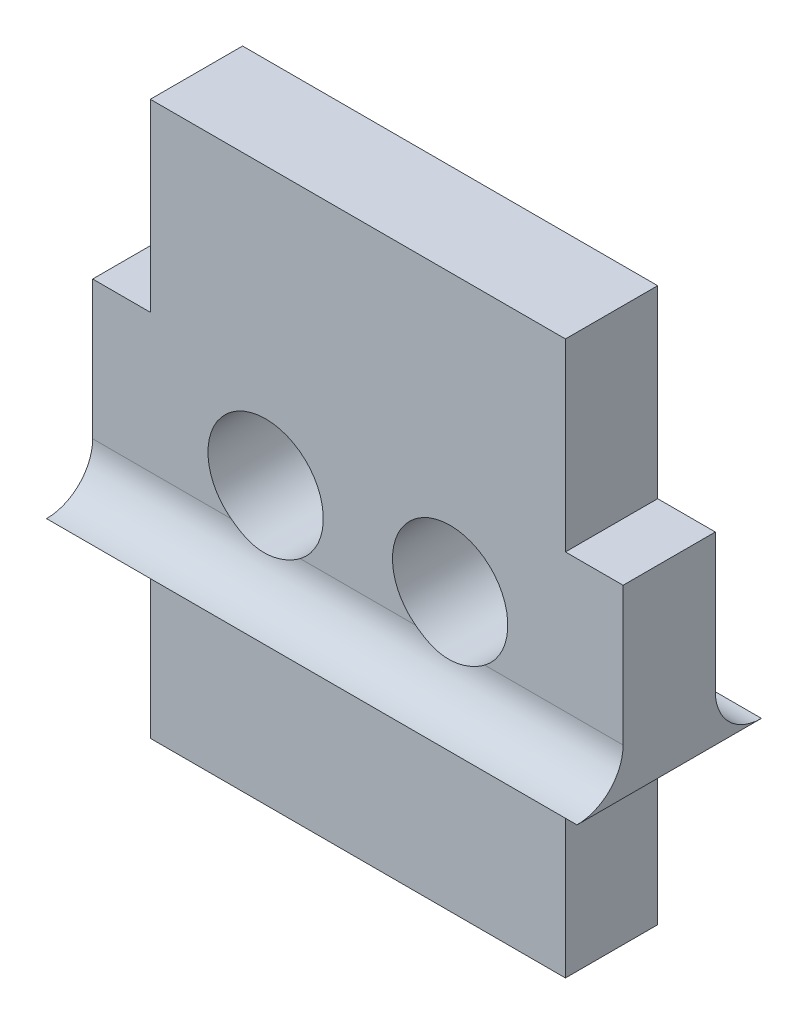
ISO-10303-21;
HEADER;
FILE_DESCRIPTION(('STEP AP214'),'2;1');
FILE_NAME('part.step','',(''),(''),'','','');
FILE_SCHEMA(('AUTOMOTIVE_DESIGN { 1 0 10303 214 1 1 1 1 }'));
ENDSEC;
DATA;
#1=APPLICATION_CONTEXT('core data for automotive mechanical design processes');
#2=APPLICATION_PROTOCOL_DEFINITION('international standard','automotive_design',2000,#1);
#3=PRODUCT_CONTEXT('',#1,'mechanical');
#4=PRODUCT('Part','Part','',(#3));
#5=PRODUCT_RELATED_PRODUCT_CATEGORY('part','',(#4));
#6=PRODUCT_DEFINITION_FORMATION('','',#4);
#7=PRODUCT_DEFINITION_CONTEXT('part definition',#1,'design');
#8=PRODUCT_DEFINITION('design','',#6,#7);
#9=PRODUCT_DEFINITION_SHAPE('','',#8);
#10=(LENGTH_UNIT() NAMED_UNIT(*) SI_UNIT(.MILLI.,.METRE.));
#11=(NAMED_UNIT(*) PLANE_ANGLE_UNIT() SI_UNIT($,.RADIAN.));
#12=(NAMED_UNIT(*) SI_UNIT($,.STERADIAN.) SOLID_ANGLE_UNIT());
#13=UNCERTAINTY_MEASURE_WITH_UNIT(LENGTH_MEASURE(1.E-05),#10,'distance_accuracy_value','');
#14=(GEOMETRIC_REPRESENTATION_CONTEXT(3) GLOBAL_UNCERTAINTY_ASSIGNED_CONTEXT((#13)) GLOBAL_UNIT_ASSIGNED_CONTEXT((#10,
#11,#12)) REPRESENTATION_CONTEXT('',''));
#15=CARTESIAN_POINT('',(0.,0.,0.));
#16=DIRECTION('',(0.,0.,1.));
#17=DIRECTION('',(1.,0.,0.));
#18=AXIS2_PLACEMENT_3D('',#15,#16,#17);
#19=CARTESIAN_POINT('',(0.,0.,0.));
#20=DIRECTION('',(0.,0.,1.));
#21=DIRECTION('',(1.,0.,0.));
#22=AXIS2_PLACEMENT_3D('',#19,#20,#21);
#23=PLANE('',#22);
#24=DIRECTION('',(-1.,0.,0.));
#25=VECTOR('',#24,1.);
#26=CARTESIAN_POINT('',(12.914933562373,5.,0.));
#27=LINE('',#26,#25);
#28=CARTESIAN_POINT('',(3.00000000000032,5.,0.));
#29=VERTEX_POINT('',#28);
#30=CARTESIAN_POINT('',(0.,5.,0.));
#31=VERTEX_POINT('',#30);
#32=EDGE_CURVE('E61',#29,#31,#27,.T.);
#33=ORIENTED_EDGE('',*,*,#32,.T.);
#34=DIRECTION('',(0.,-1.,0.));
#35=VECTOR('',#34,1.);
#36=CARTESIAN_POINT('',(0.,8.00000000000001,0.));
#37=LINE('',#36,#35);
#38=CARTESIAN_POINT('',(0.,8.00000000000001,0.));
#39=VERTEX_POINT('',#38);
#40=EDGE_CURVE('E218',#39,#31,#37,.T.);
#41=ORIENTED_EDGE('',*,*,#40,.F.);
#42=DIRECTION('',(-1.,0.,0.));
#43=VECTOR('',#42,1.);
#44=CARTESIAN_POINT('',(1.24999999999997,8.00000000000001,0.));
#45=LINE('',#44,#43);
#46=CARTESIAN_POINT('',(1.24999999999997,8.00000000000001,0.));
#47=VERTEX_POINT('',#46);
#48=EDGE_CURVE('E255',#47,#39,#45,.T.);
#49=ORIENTED_EDGE('',*,*,#48,.F.);
#50=DIRECTION('',(0.,-1.,0.));
#51=VECTOR('',#50,1.);
#52=CARTESIAN_POINT('',(1.24999999999997,8.00000000000001,0.));
#53=LINE('',#52,#51);
#54=CARTESIAN_POINT('',(1.24999999999997,12.,0.));
#55=VERTEX_POINT('',#54);
#56=EDGE_CURVE('E253',#55,#47,#53,.T.);
#57=ORIENTED_EDGE('',*,*,#56,.F.);
#58=DIRECTION('',(-1.,0.,0.));
#59=VECTOR('',#58,1.);
#60=CARTESIAN_POINT('',(10.25072,12.,0.));
#61=LINE('',#60,#59);
#62=CARTESIAN_POINT('',(10.25072,12.,0.));
#63=VERTEX_POINT('',#62);
#64=EDGE_CURVE('E251',#63,#55,#61,.T.);
#65=ORIENTED_EDGE('',*,*,#64,.F.);
#66=DIRECTION('',(0.,1.,0.));
#67=VECTOR('',#66,1.);
#68=CARTESIAN_POINT('',(10.25072,8.00000000000001,0.));
#69=LINE('',#68,#67);
#70=CARTESIAN_POINT('',(10.25072,8.00000000000001,0.));
#71=VERTEX_POINT('',#70);
#72=EDGE_CURVE('E249',#71,#63,#69,.T.);
#73=ORIENTED_EDGE('',*,*,#72,.F.);
#74=DIRECTION('',(-1.,0.,0.));
#75=VECTOR('',#74,1.);
#76=CARTESIAN_POINT('',(10.25072,8.00000000000001,0.));
#77=LINE('',#76,#75);
#78=CARTESIAN_POINT('',(11.5007199999999,8.00000000000001,0.));
#79=VERTEX_POINT('',#78);
#80=EDGE_CURVE('E247',#79,#71,#77,.T.);
#81=ORIENTED_EDGE('',*,*,#80,.F.);
#82=DIRECTION('',(0.,1.,0.));
#83=VECTOR('',#82,1.);
#84=CARTESIAN_POINT('',(11.5007199999999,8.00000000000001,0.));
#85=LINE('',#84,#83);
#86=CARTESIAN_POINT('',(11.5007199999999,5.,0.));
#87=VERTEX_POINT('',#86);
#88=EDGE_CURVE('E54',#87,#79,#85,.T.);
#89=ORIENTED_EDGE('',*,*,#88,.F.);
#90=CARTESIAN_POINT('',(8.50071999999964,5.,0.));
#91=VERTEX_POINT('',#90);
#92=EDGE_CURVE('E172',#87,#91,#27,.T.);
#93=ORIENTED_EDGE('',*,*,#92,.T.);
#94=CARTESIAN_POINT('',(7.75071999999997,6.00000000000023,0.));
#95=DIRECTION('',(0.,0.,1.));
#96=DIRECTION('',(1.,0.,0.));
#97=AXIS2_PLACEMENT_3D('',#94,#95,#96);
#98=CIRCLE('',#97,1.24999999999998);
#99=CARTESIAN_POINT('',(7.00072000000032,5.,0.));
#100=VERTEX_POINT('',#99);
#101=EDGE_CURVE('E166',#91,#100,#98,.T.);
#102=ORIENTED_EDGE('',*,*,#101,.T.);
#103=CARTESIAN_POINT('',(4.49999999999962,5.,0.));
#104=VERTEX_POINT('',#103);
#105=EDGE_CURVE('E171',#100,#104,#27,.T.);
#106=ORIENTED_EDGE('',*,*,#105,.T.);
#107=CARTESIAN_POINT('',(3.74999999999997,6.00000000000023,0.));
#108=DIRECTION('',(0.,0.,1.));
#109=DIRECTION('',(1.,0.,0.));
#110=AXIS2_PLACEMENT_3D('',#107,#108,#109);
#111=CIRCLE('',#110,1.24999999999997);
#112=EDGE_CURVE('E207',#104,#29,#111,.T.);
#113=ORIENTED_EDGE('',*,*,#112,.T.);
#114=EDGE_LOOP('',(#33,#41,#49,#57,#65,#73,#81,#89,#93,#102,#106,#113));
#115=FACE_BOUND('',#114,.T.);
#116=ADVANCED_FACE('F34',(#115),#23,.F.);
#117=CARTESIAN_POINT('',(0.,0.,2.));
#118=DIRECTION('',(0.,0.,1.));
#119=DIRECTION('',(1.,0.,0.));
#120=AXIS2_PLACEMENT_3D('',#117,#118,#119);
#121=PLANE('',#120);
#122=DIRECTION('',(0.,-1.,0.));
#123=VECTOR('',#122,1.);
#124=CARTESIAN_POINT('',(0.,8.00000000000001,2.));
#125=LINE('',#124,#123);
#126=CARTESIAN_POINT('',(0.,8.00000000000001,2.));
#127=VERTEX_POINT('',#126);
#128=CARTESIAN_POINT('',(0.,5.,2.));
#129=VERTEX_POINT('',#128);
#130=EDGE_CURVE('E235',#127,#129,#125,.T.);
#131=ORIENTED_EDGE('',*,*,#130,.T.);
#132=DIRECTION('',(-1.,0.,0.));
#133=VECTOR('',#132,1.);
#134=CARTESIAN_POINT('',(12.914933562373,5.,2.));
#135=LINE('',#134,#133);
#136=CARTESIAN_POINT('',(3.00000000000032,5.,2.));
#137=VERTEX_POINT('',#136);
#138=EDGE_CURVE('E202',#137,#129,#135,.T.);
#139=ORIENTED_EDGE('',*,*,#138,.F.);
#140=CARTESIAN_POINT('',(3.74999999999997,6.00000000000023,2.));
#141=DIRECTION('',(0.,0.,1.));
#142=DIRECTION('',(1.,0.,0.));
#143=AXIS2_PLACEMENT_3D('',#140,#141,#142);
#144=CIRCLE('',#143,1.24999999999997);
#145=CARTESIAN_POINT('',(4.49999999999962,5.,2.));
#146=VERTEX_POINT('',#145);
#147=EDGE_CURVE('E174',#146,#137,#144,.T.);
#148=ORIENTED_EDGE('',*,*,#147,.F.);
#149=CARTESIAN_POINT('',(7.00072000000031,5.,2.));
#150=VERTEX_POINT('',#149);
#151=EDGE_CURVE('E201',#150,#146,#135,.T.);
#152=ORIENTED_EDGE('',*,*,#151,.F.);
#153=CARTESIAN_POINT('',(7.75071999999997,6.00000000000023,2.));
#154=DIRECTION('',(0.,0.,1.));
#155=DIRECTION('',(1.,0.,0.));
#156=AXIS2_PLACEMENT_3D('',#153,#154,#155);
#157=CIRCLE('',#156,1.24999999999998);
#158=CARTESIAN_POINT('',(8.50071999999963,5.,2.));
#159=VERTEX_POINT('',#158);
#160=EDGE_CURVE('E173',#159,#150,#157,.T.);
#161=ORIENTED_EDGE('',*,*,#160,.F.);
#162=CARTESIAN_POINT('',(11.5007199999999,5.,2.));
#163=VERTEX_POINT('',#162);
#164=EDGE_CURVE('E198',#163,#159,#135,.T.);
#165=ORIENTED_EDGE('',*,*,#164,.F.);
#166=DIRECTION('',(0.,1.,0.));
#167=VECTOR('',#166,1.);
#168=CARTESIAN_POINT('',(11.5007199999999,8.00000000000001,2.));
#169=LINE('',#168,#167);
#170=CARTESIAN_POINT('',(11.5007199999999,8.00000000000001,2.));
#171=VERTEX_POINT('',#170);
#172=EDGE_CURVE('E223',#163,#171,#169,.T.);
#173=ORIENTED_EDGE('',*,*,#172,.T.);
#174=DIRECTION('',(-1.,0.,0.));
#175=VECTOR('',#174,1.);
#176=CARTESIAN_POINT('',(10.25072,8.00000000000001,2.));
#177=LINE('',#176,#175);
#178=CARTESIAN_POINT('',(10.25072,8.00000000000001,2.));
#179=VERTEX_POINT('',#178);
#180=EDGE_CURVE('E225',#171,#179,#177,.T.);
#181=ORIENTED_EDGE('',*,*,#180,.T.);
#182=DIRECTION('',(0.,1.,0.));
#183=VECTOR('',#182,1.);
#184=CARTESIAN_POINT('',(10.25072,8.00000000000001,2.));
#185=LINE('',#184,#183);
#186=CARTESIAN_POINT('',(10.25072,12.,2.));
#187=VERTEX_POINT('',#186);
#188=EDGE_CURVE('E227',#179,#187,#185,.T.);
#189=ORIENTED_EDGE('',*,*,#188,.T.);
#190=DIRECTION('',(-1.,0.,0.));
#191=VECTOR('',#190,1.);
#192=CARTESIAN_POINT('',(10.25072,12.,2.));
#193=LINE('',#192,#191);
#194=CARTESIAN_POINT('',(1.24999999999997,12.,2.));
#195=VERTEX_POINT('',#194);
#196=EDGE_CURVE('E229',#187,#195,#193,.T.);
#197=ORIENTED_EDGE('',*,*,#196,.T.);
#198=DIRECTION('',(0.,-1.,0.));
#199=VECTOR('',#198,1.);
#200=CARTESIAN_POINT('',(1.24999999999997,8.00000000000001,2.));
#201=LINE('',#200,#199);
#202=CARTESIAN_POINT('',(1.24999999999997,8.00000000000001,2.));
#203=VERTEX_POINT('',#202);
#204=EDGE_CURVE('E231',#195,#203,#201,.T.);
#205=ORIENTED_EDGE('',*,*,#204,.T.);
#206=DIRECTION('',(-1.,0.,0.));
#207=VECTOR('',#206,1.);
#208=CARTESIAN_POINT('',(1.24999999999997,8.00000000000001,2.));
#209=LINE('',#208,#207);
#210=EDGE_CURVE('E233',#203,#127,#209,.T.);
#211=ORIENTED_EDGE('',*,*,#210,.T.);
#212=EDGE_LOOP('',(#131,#139,#148,#152,#161,#165,#173,#181,#189,#197,#205,#211));
#213=FACE_BOUND('',#212,.T.);
#214=ADVANCED_FACE('F308',(#213),#121,.T.);
#215=DIRECTION('',(-1.,0.,0.));
#216=VECTOR('',#215,1.);
#217=CARTESIAN_POINT('',(12.914933562373,4.,2.));
#218=LINE('',#217,#216);
#219=CARTESIAN_POINT('',(10.25072,4.,2.));
#220=VERTEX_POINT('',#219);
#221=CARTESIAN_POINT('',(1.24999999999997,4.,2.));
#222=VERTEX_POINT('',#221);
#223=EDGE_CURVE('E195',#220,#222,#218,.T.);
#224=ORIENTED_EDGE('',*,*,#223,.T.);
#225=DIRECTION('',(0.,-1.,0.));
#226=VECTOR('',#225,1.);
#227=CARTESIAN_POINT('',(1.24999999999997,4.,2.));
#228=LINE('',#227,#226);
#229=CARTESIAN_POINT('',(1.24999999999997,0.,2.));
#230=VERTEX_POINT('',#229);
#231=EDGE_CURVE('E214',#222,#230,#228,.T.);
#232=ORIENTED_EDGE('',*,*,#231,.T.);
#233=DIRECTION('',(1.,0.,0.));
#234=VECTOR('',#233,1.);
#235=CARTESIAN_POINT('',(1.24999999999997,0.,2.));
#236=LINE('',#235,#234);
#237=CARTESIAN_POINT('',(10.25072,0.,2.));
#238=VERTEX_POINT('',#237);
#239=EDGE_CURVE('E217',#230,#238,#236,.T.);
#240=ORIENTED_EDGE('',*,*,#239,.T.);
#241=DIRECTION('',(0.,1.,0.));
#242=VECTOR('',#241,1.);
#243=CARTESIAN_POINT('',(10.25072,4.,2.));
#244=LINE('',#243,#242);
#245=EDGE_CURVE('E220',#238,#220,#244,.T.);
#246=ORIENTED_EDGE('',*,*,#245,.T.);
#247=EDGE_LOOP('',(#224,#232,#240,#246));
#248=FACE_BOUND('',#247,.T.);
#249=ADVANCED_FACE('F306',(#248),#121,.T.);
#250=DIRECTION('',(0.,-1.,0.));
#251=VECTOR('',#250,1.);
#252=CARTESIAN_POINT('',(1.24999999999997,4.,0.));
#253=LINE('',#252,#251);
#254=CARTESIAN_POINT('',(1.24999999999997,4.,0.));
#255=VERTEX_POINT('',#254);
#256=CARTESIAN_POINT('',(1.24999999999997,0.,0.));
#257=VERTEX_POINT('',#256);
#258=EDGE_CURVE('E212',#255,#257,#253,.T.);
#259=ORIENTED_EDGE('',*,*,#258,.F.);
#260=DIRECTION('',(-1.,0.,0.));
#261=VECTOR('',#260,1.);
#262=CARTESIAN_POINT('',(12.914933562373,4.,0.));
#263=LINE('',#262,#261);
#264=CARTESIAN_POINT('',(10.25072,4.,0.));
#265=VERTEX_POINT('',#264);
#266=EDGE_CURVE('E181',#265,#255,#263,.T.);
#267=ORIENTED_EDGE('',*,*,#266,.F.);
#268=DIRECTION('',(0.,1.,0.));
#269=VECTOR('',#268,1.);
#270=CARTESIAN_POINT('',(10.25072,4.,0.));
#271=LINE('',#270,#269);
#272=CARTESIAN_POINT('',(10.25072,0.,0.));
#273=VERTEX_POINT('',#272);
#274=EDGE_CURVE('E243',#273,#265,#271,.T.);
#275=ORIENTED_EDGE('',*,*,#274,.F.);
#276=DIRECTION('',(1.,0.,0.));
#277=VECTOR('',#276,1.);
#278=CARTESIAN_POINT('',(1.24999999999997,0.,0.));
#279=LINE('',#278,#277);
#280=EDGE_CURVE('E241',#257,#273,#279,.T.);
#281=ORIENTED_EDGE('',*,*,#280,.F.);
#282=EDGE_LOOP('',(#259,#267,#275,#281));
#283=FACE_BOUND('',#282,.T.);
#284=ADVANCED_FACE('F296',(#283),#23,.F.);
#285=CARTESIAN_POINT('',(1.24999999999997,4.,2.));
#286=DIRECTION('',(1.,0.,0.));
#287=DIRECTION('',(0.,1.,0.));
#288=AXIS2_PLACEMENT_3D('',#285,#286,#287);
#289=PLANE('',#288);
#290=ORIENTED_EDGE('',*,*,#258,.T.);
#291=DIRECTION('',(0.,0.,-1.));
#292=VECTOR('',#291,1.);
#293=CARTESIAN_POINT('',(1.24999999999997,0.,2.));
#294=LINE('',#293,#292);
#295=EDGE_CURVE('E47',#230,#257,#294,.T.);
#296=ORIENTED_EDGE('',*,*,#295,.F.);
#297=ORIENTED_EDGE('',*,*,#231,.F.);
#298=DIRECTION('',(0.,0.,-1.));
#299=VECTOR('',#298,1.);
#300=CARTESIAN_POINT('',(1.24999999999997,4.,2.));
#301=LINE('',#300,#299);
#302=EDGE_CURVE('E238',#222,#255,#301,.T.);
#303=ORIENTED_EDGE('',*,*,#302,.T.);
#304=EDGE_LOOP('',(#290,#296,#297,#303));
#305=FACE_BOUND('',#304,.T.);
#306=ADVANCED_FACE('F36',(#305),#289,.F.);
#307=CARTESIAN_POINT('',(1.24999999999997,0.,2.));
#308=DIRECTION('',(0.,1.,0.));
#309=DIRECTION('',(-1.,0.,0.));
#310=AXIS2_PLACEMENT_3D('',#307,#308,#309);
#311=PLANE('',#310);
#312=ORIENTED_EDGE('',*,*,#280,.T.);
#313=DIRECTION('',(0.,0.,-1.));
#314=VECTOR('',#313,1.);
#315=CARTESIAN_POINT('',(10.25072,0.,2.));
#316=LINE('',#315,#314);
#317=EDGE_CURVE('E284',#238,#273,#316,.T.);
#318=ORIENTED_EDGE('',*,*,#317,.F.);
#319=ORIENTED_EDGE('',*,*,#239,.F.);
#320=ORIENTED_EDGE('',*,*,#295,.T.);
#321=EDGE_LOOP('',(#312,#318,#319,#320));
#322=FACE_BOUND('',#321,.T.);
#323=ADVANCED_FACE('F289',(#322),#311,.F.);
#324=CARTESIAN_POINT('',(10.25072,4.,2.));
#325=DIRECTION('',(-1.,0.,0.));
#326=DIRECTION('',(0.,-1.,0.));
#327=AXIS2_PLACEMENT_3D('',#324,#325,#326);
#328=PLANE('',#327);
#329=ORIENTED_EDGE('',*,*,#274,.T.);
#330=DIRECTION('',(0.,0.,-1.));
#331=VECTOR('',#330,1.);
#332=CARTESIAN_POINT('',(10.25072,4.,2.));
#333=LINE('',#332,#331);
#334=EDGE_CURVE('E281',#220,#265,#333,.T.);
#335=ORIENTED_EDGE('',*,*,#334,.F.);
#336=ORIENTED_EDGE('',*,*,#245,.F.);
#337=ORIENTED_EDGE('',*,*,#317,.T.);
#338=EDGE_LOOP('',(#329,#335,#336,#337));
#339=FACE_BOUND('',#338,.T.);
#340=ADVANCED_FACE('F304',(#339),#328,.F.);
#341=CARTESIAN_POINT('',(11.5007199999999,8.00000000000001,2.));
#342=DIRECTION('',(-1.,0.,0.));
#343=DIRECTION('',(0.,0.,1.));
#344=AXIS2_PLACEMENT_3D('',#341,#342,#343);
#345=PLANE('',#344);
#346=DIRECTION('',(0.,0.,-1.));
#347=VECTOR('',#346,1.);
#348=CARTESIAN_POINT('',(11.5007199999999,4.,2.));
#349=LINE('',#348,#347);
#350=CARTESIAN_POINT('',(11.5007199999999,4.,3.));
#351=VERTEX_POINT('',#350);
#352=CARTESIAN_POINT('',(11.5007199999999,4.,-1.));
#353=VERTEX_POINT('',#352);
#354=EDGE_CURVE('E279',#351,#353,#349,.T.);
#355=ORIENTED_EDGE('',*,*,#354,.T.);
#356=CARTESIAN_POINT('',(11.5007199999999,5.,-1.));
#357=DIRECTION('',(-1.,0.,0.));
#358=DIRECTION('',(0.,0.,1.));
#359=AXIS2_PLACEMENT_3D('',#356,#357,#358);
#360=CIRCLE('',#359,1.);
#361=EDGE_CURVE('E180',#353,#87,#360,.T.);
#362=ORIENTED_EDGE('',*,*,#361,.T.);
#363=ORIENTED_EDGE('',*,*,#88,.T.);
#364=DIRECTION('',(0.,0.,-1.));
#365=VECTOR('',#364,1.);
#366=CARTESIAN_POINT('',(11.5007199999999,8.00000000000001,2.));
#367=LINE('',#366,#365);
#368=EDGE_CURVE('E276',#171,#79,#367,.T.);
#369=ORIENTED_EDGE('',*,*,#368,.F.);
#370=ORIENTED_EDGE('',*,*,#172,.F.);
#371=CARTESIAN_POINT('',(11.5007199999999,5.,3.));
#372=DIRECTION('',(-1.,0.,0.));
#373=DIRECTION('',(0.,0.,1.));
#374=AXIS2_PLACEMENT_3D('',#371,#372,#373);
#375=CIRCLE('',#374,1.);
#376=EDGE_CURVE('E197',#163,#351,#375,.T.);
#377=ORIENTED_EDGE('',*,*,#376,.T.);
#378=EDGE_LOOP('',(#355,#362,#363,#369,#370,#377));
#379=FACE_BOUND('',#378,.T.);
#380=ADVANCED_FACE('F346',(#379),#345,.F.);
#381=CARTESIAN_POINT('',(10.25072,8.00000000000001,2.));
#382=DIRECTION('',(0.,-1.,0.));
#383=DIRECTION('',(0.,0.,-1.));
#384=AXIS2_PLACEMENT_3D('',#381,#382,#383);
#385=PLANE('',#384);
#386=ORIENTED_EDGE('',*,*,#80,.T.);
#387=DIRECTION('',(0.,0.,-1.));
#388=VECTOR('',#387,1.);
#389=CARTESIAN_POINT('',(10.25072,8.00000000000001,2.));
#390=LINE('',#389,#388);
#391=EDGE_CURVE('E273',#179,#71,#390,.T.);
#392=ORIENTED_EDGE('',*,*,#391,.F.);
#393=ORIENTED_EDGE('',*,*,#180,.F.);
#394=ORIENTED_EDGE('',*,*,#368,.T.);
#395=EDGE_LOOP('',(#386,#392,#393,#394));
#396=FACE_BOUND('',#395,.T.);
#397=ADVANCED_FACE('F342',(#396),#385,.F.);
#398=CARTESIAN_POINT('',(10.25072,8.00000000000001,2.));
#399=DIRECTION('',(-1.,0.,0.));
#400=DIRECTION('',(0.,-1.,0.));
#401=AXIS2_PLACEMENT_3D('',#398,#399,#400);
#402=PLANE('',#401);
#403=ORIENTED_EDGE('',*,*,#72,.T.);
#404=DIRECTION('',(0.,0.,-1.));
#405=VECTOR('',#404,1.);
#406=CARTESIAN_POINT('',(10.25072,12.,2.));
#407=LINE('',#406,#405);
#408=EDGE_CURVE('E270',#187,#63,#407,.T.);
#409=ORIENTED_EDGE('',*,*,#408,.F.);
#410=ORIENTED_EDGE('',*,*,#188,.F.);
#411=ORIENTED_EDGE('',*,*,#391,.T.);
#412=EDGE_LOOP('',(#403,#409,#410,#411));
#413=FACE_BOUND('',#412,.T.);
#414=ADVANCED_FACE('F338',(#413),#402,.F.);
#415=CARTESIAN_POINT('',(10.25072,12.,2.));
#416=DIRECTION('',(0.,-1.,0.));
#417=DIRECTION('',(1.,0.,0.));
#418=AXIS2_PLACEMENT_3D('',#415,#416,#417);
#419=PLANE('',#418);
#420=ORIENTED_EDGE('',*,*,#64,.T.);
#421=DIRECTION('',(0.,0.,-1.));
#422=VECTOR('',#421,1.);
#423=CARTESIAN_POINT('',(1.24999999999997,12.,2.));
#424=LINE('',#423,#422);
#425=EDGE_CURVE('E267',#195,#55,#424,.T.);
#426=ORIENTED_EDGE('',*,*,#425,.F.);
#427=ORIENTED_EDGE('',*,*,#196,.F.);
#428=ORIENTED_EDGE('',*,*,#408,.T.);
#429=EDGE_LOOP('',(#420,#426,#427,#428));
#430=FACE_BOUND('',#429,.T.);
#431=ADVANCED_FACE('F334',(#430),#419,.F.);
#432=CARTESIAN_POINT('',(1.24999999999997,8.00000000000001,2.));
#433=DIRECTION('',(1.,0.,0.));
#434=DIRECTION('',(0.,1.,0.));
#435=AXIS2_PLACEMENT_3D('',#432,#433,#434);
#436=PLANE('',#435);
#437=ORIENTED_EDGE('',*,*,#56,.T.);
#438=DIRECTION('',(0.,0.,-1.));
#439=VECTOR('',#438,1.);
#440=CARTESIAN_POINT('',(1.24999999999997,8.00000000000001,2.));
#441=LINE('',#440,#439);
#442=EDGE_CURVE('E264',#203,#47,#441,.T.);
#443=ORIENTED_EDGE('',*,*,#442,.F.);
#444=ORIENTED_EDGE('',*,*,#204,.F.);
#445=ORIENTED_EDGE('',*,*,#425,.T.);
#446=EDGE_LOOP('',(#437,#443,#444,#445));
#447=FACE_BOUND('',#446,.T.);
#448=ADVANCED_FACE('F330',(#447),#436,.F.);
#449=CARTESIAN_POINT('',(1.24999999999997,8.00000000000001,2.));
#450=DIRECTION('',(0.,-1.,0.));
#451=DIRECTION('',(0.,0.,-1.));
#452=AXIS2_PLACEMENT_3D('',#449,#450,#451);
#453=PLANE('',#452);
#454=ORIENTED_EDGE('',*,*,#48,.T.);
#455=DIRECTION('',(0.,0.,-1.));
#456=VECTOR('',#455,1.);
#457=CARTESIAN_POINT('',(0.,8.00000000000001,2.));
#458=LINE('',#457,#456);
#459=EDGE_CURVE('E261',#127,#39,#458,.T.);
#460=ORIENTED_EDGE('',*,*,#459,.F.);
#461=ORIENTED_EDGE('',*,*,#210,.F.);
#462=ORIENTED_EDGE('',*,*,#442,.T.);
#463=EDGE_LOOP('',(#454,#460,#461,#462));
#464=FACE_BOUND('',#463,.T.);
#465=ADVANCED_FACE('F326',(#464),#453,.F.);
#466=CARTESIAN_POINT('',(0.,8.00000000000001,2.));
#467=DIRECTION('',(1.,0.,0.));
#468=DIRECTION('',(0.,1.,0.));
#469=AXIS2_PLACEMENT_3D('',#466,#467,#468);
#470=PLANE('',#469);
#471=ORIENTED_EDGE('',*,*,#40,.T.);
#472=CARTESIAN_POINT('',(0.,5.,-1.));
#473=DIRECTION('',(1.,0.,0.));
#474=DIRECTION('',(0.,1.,0.));
#475=AXIS2_PLACEMENT_3D('',#472,#473,#474);
#476=CIRCLE('',#475,1.);
#477=CARTESIAN_POINT('',(0.,4.,-1.));
#478=VERTEX_POINT('',#477);
#479=EDGE_CURVE('E184',#31,#478,#476,.T.);
#480=ORIENTED_EDGE('',*,*,#479,.T.);
#481=DIRECTION('',(0.,0.,-1.));
#482=VECTOR('',#481,1.);
#483=CARTESIAN_POINT('',(0.,4.,2.));
#484=LINE('',#483,#482);
#485=CARTESIAN_POINT('',(0.,4.,3.));
#486=VERTEX_POINT('',#485);
#487=EDGE_CURVE('E259',#486,#478,#484,.T.);
#488=ORIENTED_EDGE('',*,*,#487,.F.);
#489=CARTESIAN_POINT('',(0.,5.,3.));
#490=DIRECTION('',(1.,0.,0.));
#491=DIRECTION('',(0.,-1.,0.));
#492=AXIS2_PLACEMENT_3D('',#489,#490,#491);
#493=CIRCLE('',#492,1.);
#494=EDGE_CURVE('E191',#486,#129,#493,.T.);
#495=ORIENTED_EDGE('',*,*,#494,.T.);
#496=ORIENTED_EDGE('',*,*,#130,.F.);
#497=ORIENTED_EDGE('',*,*,#459,.T.);
#498=EDGE_LOOP('',(#471,#480,#488,#495,#496,#497));
#499=FACE_BOUND('',#498,.T.);
#500=ADVANCED_FACE('F323',(#499),#470,.F.);
#501=CARTESIAN_POINT('',(1.24999999999997,4.,2.));
#502=DIRECTION('',(0.,1.,0.));
#503=DIRECTION('',(0.,0.,1.));
#504=AXIS2_PLACEMENT_3D('',#501,#502,#503);
#505=PLANE('',#504);
#506=ORIENTED_EDGE('',*,*,#266,.T.);
#507=ORIENTED_EDGE('',*,*,#302,.F.);
#508=ORIENTED_EDGE('',*,*,#223,.F.);
#509=ORIENTED_EDGE('',*,*,#334,.T.);
#510=EDGE_LOOP('',(#506,#507,#508,#509));
#511=FACE_BOUND('',#510,.T.);
#512=ORIENTED_EDGE('',*,*,#487,.T.);
#513=DIRECTION('',(-1.,0.,0.));
#514=VECTOR('',#513,1.);
#515=CARTESIAN_POINT('',(12.914933562373,4.,-1.));
#516=LINE('',#515,#514);
#517=EDGE_CURVE('E188',#353,#478,#516,.T.);
#518=ORIENTED_EDGE('',*,*,#517,.F.);
#519=ORIENTED_EDGE('',*,*,#354,.F.);
#520=DIRECTION('',(-1.,0.,0.));
#521=VECTOR('',#520,1.);
#522=CARTESIAN_POINT('',(12.914933562373,4.,3.));
#523=LINE('',#522,#521);
#524=EDGE_CURVE('E194',#351,#486,#523,.T.);
#525=ORIENTED_EDGE('',*,*,#524,.T.);
#526=EDGE_LOOP('',(#512,#518,#519,#525));
#527=FACE_BOUND('',#526,.T.);
#528=ADVANCED_FACE('F299',(#511,#527),#505,.F.);
#529=CARTESIAN_POINT('',(7.75071999999997,6.00000000000023,2.));
#530=DIRECTION('',(0.,0.,-1.));
#531=DIRECTION('',(-1.,0.,0.));
#532=AXIS2_PLACEMENT_3D('',#529,#530,#531);
#533=CYLINDRICAL_SURFACE('',#532,1.24999999999998);
#534=ORIENTED_EDGE('',*,*,#160,.T.);
#535=CARTESIAN_POINT('',(6.50072,6.,3.));
#536=CARTESIAN_POINT('',(6.50072532169146,5.99999978361962,2.97204992704358));
#537=CARTESIAN_POINT('',(6.50071939610446,5.99882745440819,2.9441131972668));
#538=CARTESIAN_POINT('',(6.50073046598745,5.99415030073656,2.88843631015914));
#539=CARTESIAN_POINT('',(6.50074746097995,5.99064552486542,2.86069614874554));
#540=CARTESIAN_POINT('',(6.50090094022251,5.97665054069726,2.77802649176053));
#541=CARTESIAN_POINT('',(6.50113990971723,5.96267967333993,2.72364483905864));
#542=CARTESIAN_POINT('',(6.50278662214765,5.92584624654431,2.61797088191552));
#543=CARTESIAN_POINT('',(6.50419535772504,5.90297614414265,2.5666812409598));
#544=CARTESIAN_POINT('',(6.50957283886306,5.84905409519246,2.46875147393668));
#545=CARTESIAN_POINT('',(6.51353998426913,5.81800726994184,2.422108462677));
#546=CARTESIAN_POINT('',(6.52554707147617,5.74976709316367,2.33608412192638));
#547=CARTESIAN_POINT('',(6.53347946503019,5.71275267904168,2.2965466821992));
#548=CARTESIAN_POINT('',(6.55488696571303,5.6337368256466,2.2246138986495));
#549=CARTESIAN_POINT('',(6.5683566501472,5.59174029392989,2.19221161487647));
#550=CARTESIAN_POINT('',(6.60033915577241,5.50919134506977,2.13806611689877));
#551=CARTESIAN_POINT('',(6.61825588390264,5.46887683924685,2.11560544227966));
#552=CARTESIAN_POINT('',(6.65980351938817,5.38806641572971,2.07728408580201));
#553=CARTESIAN_POINT('',(6.68343424400287,5.34757050387771,2.0614231929185));
#554=CARTESIAN_POINT('',(6.73523659665331,5.2696514541779,2.03619966154708));
#555=CARTESIAN_POINT('',(6.76322393193426,5.23217052849071,2.02663214527757));
#556=CARTESIAN_POINT('',(6.82374194947047,5.16010161782889,2.0122144777549));
#557=CARTESIAN_POINT('',(6.856274290725,5.12551469661602,2.00736605421709));
#558=CARTESIAN_POINT('',(6.92945872859267,5.05613898673155,2.0008963891932));
#559=CARTESIAN_POINT('',(6.9706172919172,5.02184368283418,1.99974280360213));
#560=CARTESIAN_POINT('',(7.05697101598225,4.95880959112038,2.00035077178162));
#561=CARTESIAN_POINT('',(7.10216939804423,4.93007529644919,2.00211467190863));
#562=CARTESIAN_POINT('',(7.20524370870765,4.87346978488139,2.00755027815467));
#563=CARTESIAN_POINT('',(7.26384075093854,4.84693522897629,2.01153441073528));
#564=CARTESIAN_POINT('',(7.38442418322838,4.80315151527515,2.01931330599981));
#565=CARTESIAN_POINT('',(7.44641164051076,4.78590529997748,2.02310800832818));
#566=CARTESIAN_POINT('',(7.57842588452386,4.75993775182277,2.02913832605215));
#567=CARTESIAN_POINT('',(7.64865574404498,4.75218578355409,2.03119083642386));
#568=CARTESIAN_POINT('',(7.78942421870189,4.74861724429449,2.03211032718628));
#569=CARTESIAN_POINT('',(7.8599627717348,4.7527983737185,2.03097792133153));
#570=CARTESIAN_POINT('',(7.99719495889271,4.77263724561326,2.02614044681261));
#571=CARTESIAN_POINT('',(8.063940750725,4.78795762791373,2.02251116782302));
#572=CARTESIAN_POINT('',(8.19406539328195,4.82926926560037,2.0144593500494));
#573=CARTESIAN_POINT('',(8.25744046850784,4.85527221346863,2.0100359450599));
#574=CARTESIAN_POINT('',(8.38102967718007,4.91825821224949,2.0028273129751));
#575=CARTESIAN_POINT('',(8.44109165479262,4.9555476557265,2.00009529153889));
#576=CARTESIAN_POINT('',(8.55403621794822,5.0397337462953,1.99991026215672));
#577=CARTESIAN_POINT('',(8.60693400316511,5.08660950679127,2.00244588528641));
#578=CARTESIAN_POINT('',(8.69017928767852,5.17387180734177,2.01453855024301));
#579=CARTESIAN_POINT('',(8.72271722033839,5.212467219141,2.02195960479528));
#580=CARTESIAN_POINT('',(8.78224679651315,5.29224299954566,2.0427710050816));
#581=CARTESIAN_POINT('',(8.80924376580793,5.33342083582994,2.05615557927127));
#582=CARTESIAN_POINT('',(8.85733112585975,5.41670278630373,2.08984480805756));
#583=CARTESIAN_POINT('',(8.8783937406162,5.4588102931143,2.11018104988533));
#584=CARTESIAN_POINT('',(8.91449184072981,5.54155119806155,2.15797690000796));
#585=CARTESIAN_POINT('',(8.92952668708271,5.58218443949619,2.18543726302353));
#586=CARTESIAN_POINT('',(8.95335054186465,5.65704979983648,2.24475039840749));
#587=CARTESIAN_POINT('',(8.96251286282049,5.69153236049709,2.27614137822856));
#588=CARTESIAN_POINT('',(8.9771443623878,5.75611198943674,2.34388549282698));
#589=CARTESIAN_POINT('',(8.9826129359274,5.78620833857858,2.38023943941481));
#590=CARTESIAN_POINT('',(8.99112313416134,5.84263813582409,2.45921483165553));
#591=CARTESIAN_POINT('',(8.99400887923185,5.86865984337178,2.50207525475577));
#592=CARTESIAN_POINT('',(8.99796868948614,5.91403249458111,2.59127815841558));
#593=CARTESIAN_POINT('',(8.99904163383959,5.93337930536606,2.63762277472509));
#594=CARTESIAN_POINT('',(9.00037107652992,5.96595332765261,2.73584249898936));
#595=CARTESIAN_POINT('',(9.00056947887205,5.97869656184542,2.78788101534216));
#596=CARTESIAN_POINT('',(9.00069708521,5.99146460992094,2.8669085241022));
#597=CARTESIAN_POINT('',(9.00071126209137,5.99466283273372,2.89342243079684));
#598=CARTESIAN_POINT('',(9.00072052862289,5.99893031356652,2.94662017774424));
#599=CARTESIAN_POINT('',(9.00071561890911,5.99999964253087,2.97330401230451));
#600=CARTESIAN_POINT('',(9.00071999999995,6.,3.));
#601=B_SPLINE_CURVE_WITH_KNOTS('',3,(#535,#536,#537,#538,#539,#540,#541,#542,#543,#544,#545,
#546,#547,#548,#549,#550,#551,#552,#553,#554,#555,#556,#557,#558,#559,#560,#561,#562,#563,#564,
#565,#566,#567,#568,#569,#570,#571,#572,#573,#574,#575,#576,#577,#578,#579,#580,#581,#582,#583,
#584,#585,#586,#587,#588,#589,#590,#591,#592,#593,#594,#595,#596,#597,#598,#599,#600),
.UNSPECIFIED.,.F.,.F.,(4,2,2,2,2,2,2,2,2,2,2,2,2,2,2,2,2,2,2,2,2,2,2,2,2,2,2,2,2,2,2,2,4),(0.,
0.0837991264591867,0.167596507286032,0.335182428328774,0.502910705164787,0.670534178146347,
0.83383965075248,0.996985577091702,1.1447307915601,1.2924712815802,1.4351265755665,
1.57783407771075,1.73800933032284,1.898313464803,2.09086826397854,2.2834840276932,
2.49446115488416,2.70539762816395,2.91019854784175,3.11522422983577,3.32640921793773,
3.53713888837388,3.6895840208512,3.84188193504676,3.99488127288407,4.14789682590834,
4.2898369515479,4.43180032273025,4.58184518650066,4.73198278709179,4.89195684490057,
4.97200189248414,5.05204427256112),.UNSPECIFIED.);
#602=EDGE_CURVE('E512',#150,#159,#601,.T.);
#603=ORIENTED_EDGE('',*,*,#602,.T.);
#604=EDGE_LOOP('',(#534,#603));
#605=FACE_BOUND('',#604,.T.);
#606=ORIENTED_EDGE('',*,*,#101,.F.);
#607=CARTESIAN_POINT('',(9.00071999999995,6.00000000000023,-1.));
#608=CARTESIAN_POINT('',(9.0007146783085,5.9999997836197,-0.972049927043585));
#609=CARTESIAN_POINT('',(9.00072060389549,5.99882745440822,-0.944113197266816));
#610=CARTESIAN_POINT('',(9.00070953401251,5.99415030073654,-0.888436310159157));
#611=CARTESIAN_POINT('',(9.00069253902,5.99064552486541,-0.860696148745559));
#612=CARTESIAN_POINT('',(9.00053905977744,5.97665054069728,-0.778026491760542));
#613=CARTESIAN_POINT('',(9.00030009028272,5.96267967333993,-0.723644839058651));
#614=CARTESIAN_POINT('',(8.99865337785231,5.92584624654431,-0.617970881915522));
#615=CARTESIAN_POINT('',(8.99724464227491,5.90297614414265,-0.566681240959797));
#616=CARTESIAN_POINT('',(8.99186716113689,5.84905409519246,-0.46875147393668));
#617=CARTESIAN_POINT('',(8.98790001573082,5.81800726994184,-0.422108462677004));
#618=CARTESIAN_POINT('',(8.97589292852379,5.74976709316367,-0.336084121926386));
#619=CARTESIAN_POINT('',(8.96796053496976,5.71275267904169,-0.296546682199207));
#620=CARTESIAN_POINT('',(8.94655303428693,5.6337368256466,-0.2246138986495));
#621=CARTESIAN_POINT('',(8.93308334985275,5.5917402939299,-0.192211614876471));
#622=CARTESIAN_POINT('',(8.90110084422754,5.50919134506978,-0.138066116898775));
#623=CARTESIAN_POINT('',(8.88318411609732,5.46887683924686,-0.115605442279658));
#624=CARTESIAN_POINT('',(8.84163648061178,5.38806641572971,-0.0772840858020151));
#625=CARTESIAN_POINT('',(8.81800575599709,5.34757050387772,-0.0614231929185052));
#626=CARTESIAN_POINT('',(8.76620340334664,5.26965145417791,-0.0361996615470828));
#627=CARTESIAN_POINT('',(8.7382160680657,5.23217052849072,-0.0266321452775715));
#628=CARTESIAN_POINT('',(8.67769805052948,5.16010161782889,-0.0122144777548965));
#629=CARTESIAN_POINT('',(8.64516570927496,5.12551469661603,-0.00736605421709508));
#630=CARTESIAN_POINT('',(8.57198127140729,5.05613898673155,-0.000896389193199293));
#631=CARTESIAN_POINT('',(8.53082270808275,5.02184368283418,0.000257196397874055));
#632=CARTESIAN_POINT('',(8.4444689840177,4.95880959112039,-0.000350771781617829));
#633=CARTESIAN_POINT('',(8.39927060195573,4.9300752964492,-0.00211467190862638));
#634=CARTESIAN_POINT('',(8.29619629129231,4.87346978488139,-0.00755027815466965));
#635=CARTESIAN_POINT('',(8.23759924906142,4.84693522897629,-0.0115344107352799));
#636=CARTESIAN_POINT('',(8.11701581677158,4.80315151527515,-0.0193133059998094));
#637=CARTESIAN_POINT('',(8.05502835948919,4.78590529997748,-0.0231080083281837));
#638=CARTESIAN_POINT('',(7.9230141154761,4.75993775182277,-0.0291383260521484));
#639=CARTESIAN_POINT('',(7.85278425595498,4.75218578355409,-0.0311908364238647));
#640=CARTESIAN_POINT('',(7.71201578129807,4.74861724429449,-0.032110327186275));
#641=CARTESIAN_POINT('',(7.64147722826516,4.7527983737185,-0.0309779213315299));
#642=CARTESIAN_POINT('',(7.50424504110725,4.77263724561326,-0.0261404468126092));
#643=CARTESIAN_POINT('',(7.43749924927496,4.78795762791373,-0.0225111678230187));
#644=CARTESIAN_POINT('',(7.30737460671801,4.82926926560037,-0.0144593500494017));
#645=CARTESIAN_POINT('',(7.24399953149211,4.85527221346863,-0.0100359450599042));
#646=CARTESIAN_POINT('',(7.12041032281989,4.91825821224948,-0.00282731297510131));
#647=CARTESIAN_POINT('',(7.06034834520733,4.9555476557265,-9.52915388884311E-05));
#648=CARTESIAN_POINT('',(6.94740378205173,5.0397337462953,8.973784328037E-05));
#649=CARTESIAN_POINT('',(6.89450599683485,5.08660950679127,-0.00244588528641195));
#650=CARTESIAN_POINT('',(6.81126071232144,5.17387180734177,-0.0145385502430097));
#651=CARTESIAN_POINT('',(6.77872277966157,5.212467219141,-0.0219596047952745));
#652=CARTESIAN_POINT('',(6.7191932034868,5.29224299954566,-0.0427710050815939));
#653=CARTESIAN_POINT('',(6.69219623419203,5.33342083582994,-0.0561555792712712));
#654=CARTESIAN_POINT('',(6.64410887414021,5.41670278630373,-0.0898448080575548));
#655=CARTESIAN_POINT('',(6.62304625938375,5.45881029311429,-0.110181049885329));
#656=CARTESIAN_POINT('',(6.58694815927015,5.54155119806154,-0.157976900007953));
#657=CARTESIAN_POINT('',(6.57191331291724,5.58218443949618,-0.185437263023527));
#658=CARTESIAN_POINT('',(6.5480894581353,5.65704979983647,-0.244750398407487));
#659=CARTESIAN_POINT('',(6.53892713717947,5.69153236049709,-0.276141378228559));
#660=CARTESIAN_POINT('',(6.52429563761215,5.75611198943674,-0.343885492826977));
#661=CARTESIAN_POINT('',(6.51882706407255,5.78620833857857,-0.38023943941481));
#662=CARTESIAN_POINT('',(6.51031686583861,5.84263813582409,-0.459214831655522));
#663=CARTESIAN_POINT('',(6.50743112076811,5.86865984337177,-0.502075254755766));
#664=CARTESIAN_POINT('',(6.50347131051381,5.91403249458111,-0.591278158415578));
#665=CARTESIAN_POINT('',(6.50239836616036,5.93337930536606,-0.637622774725083));
#666=CARTESIAN_POINT('',(6.50106892347003,5.96595332765261,-0.735842498989359));
#667=CARTESIAN_POINT('',(6.50087052112791,5.97869656184542,-0.787881015342155));
#668=CARTESIAN_POINT('',(6.50074291478995,5.99146460992094,-0.866908524102197));
#669=CARTESIAN_POINT('',(6.50072873790858,5.99466283273372,-0.893422430796835));
#670=CARTESIAN_POINT('',(6.50071947137706,5.99893031356652,-0.946620177744236));
#671=CARTESIAN_POINT('',(6.50072438109084,5.99999964253087,-0.973304012304506));
#672=CARTESIAN_POINT('',(6.50072,6.,-1.));
#673=B_SPLINE_CURVE_WITH_KNOTS('',3,(#607,#608,#609,#610,#611,#612,#613,#614,#615,#616,#617,
#618,#619,#620,#621,#622,#623,#624,#625,#626,#627,#628,#629,#630,#631,#632,#633,#634,#635,#636,
#637,#638,#639,#640,#641,#642,#643,#644,#645,#646,#647,#648,#649,#650,#651,#652,#653,#654,#655,
#656,#657,#658,#659,#660,#661,#662,#663,#664,#665,#666,#667,#668,#669,#670,#671,#672),
.UNSPECIFIED.,.F.,.F.,(4,2,2,2,2,2,2,2,2,2,2,2,2,2,2,2,2,2,2,2,2,2,2,2,2,2,2,2,2,2,2,2,4),(0.,
0.0837991264591764,0.167596507286022,0.335182428328781,0.502910705164796,0.670534178146351,
0.833839650752481,0.996985577091706,1.14473079156011,1.29247128158021,1.4351265755665,
1.57783407771076,1.73800933032285,1.898313464803,2.09086826397854,2.2834840276932,
2.49446115488416,2.70539762816395,2.91019854784175,3.11522422983577,3.32640921793773,
3.53713888837388,3.6895840208512,3.84188193504677,3.99488127288407,4.14789682590835,
4.2898369515479,4.43180032273026,4.58184518650067,4.7319827870918,4.89195684490058,
4.97200189248415,5.05204427256113),.UNSPECIFIED.);
#674=EDGE_CURVE('E11',#91,#100,#673,.T.);
#675=ORIENTED_EDGE('',*,*,#674,.T.);
#676=EDGE_LOOP('',(#606,#675));
#677=FACE_BOUND('',#676,.T.);
#678=ADVANCED_FACE('F165',(#605,#677),#533,.F.);
#679=CARTESIAN_POINT('',(3.74999999999997,6.00000000000023,2.));
#680=DIRECTION('',(0.,0.,-1.));
#681=DIRECTION('',(-1.,0.,0.));
#682=AXIS2_PLACEMENT_3D('',#679,#680,#681);
#683=CYLINDRICAL_SURFACE('',#682,1.24999999999997);
#684=ORIENTED_EDGE('',*,*,#147,.T.);
#685=CARTESIAN_POINT('',(3.00000000000032,5.,2.));
#686=CARTESIAN_POINT('',(3.0278331431426,4.97912458066792,2.00000413601013));
#687=CARTESIAN_POINT('',(3.05651573519387,4.95942963309188,2.00065286249587));
#688=CARTESIAN_POINT('',(3.11538489940349,4.92251652541845,2.00283435504109));
#689=CARTESIAN_POINT('',(3.14557079272632,4.90529726080535,2.00436672532794));
#690=CARTESIAN_POINT('',(3.23812771114339,4.85750124101838,2.00968314842713));
#691=CARTESIAN_POINT('',(3.30249999605688,4.83078474806899,2.01418657178217));
#692=CARTESIAN_POINT('',(3.43478337450802,4.78840376404801,2.02240246556488));
#693=CARTESIAN_POINT('',(3.50269340434782,4.77273597131266,2.02611517204941));
#694=CARTESIAN_POINT('',(3.64020057175382,4.75290041132145,2.0309542710304));
#695=CARTESIAN_POINT('',(3.70979542170381,4.74871784594713,2.03208399125579));
#696=CARTESIAN_POINT('',(3.84823600863441,4.75195573845742,2.03125053742895));
#697=CARTESIAN_POINT('',(3.91708367606742,4.75930107272978,2.02930738765348));
#698=CARTESIAN_POINT('',(4.05259078295548,4.78521406413087,2.0232497934037));
#699=CARTESIAN_POINT('',(4.11924794092602,4.8037930538157,2.01913315683976));
#700=CARTESIAN_POINT('',(4.24038155460577,4.84863081934761,2.01129786180182));
#701=CARTESIAN_POINT('',(4.29533093527738,4.87361745271818,2.00759490859315));
#702=CARTESIAN_POINT('',(4.37461526945795,4.91682792431902,2.00336036664731));
#703=CARTESIAN_POINT('',(4.40050907481852,4.93217825505494,2.00216907514142));
#704=CARTESIAN_POINT('',(4.45114936778264,4.96472415926574,2.00048997066707));
#705=CARTESIAN_POINT('',(4.47589531964558,4.98192058220541,2.00000248305197));
#706=CARTESIAN_POINT('',(4.49999999999962,5.,2.));
#707=B_SPLINE_CURVE_WITH_KNOTS('',3,(#685,#686,#687,#688,#689,#690,#691,#692,#693,#694,#695,
#696,#697,#698,#699,#700,#701,#702,#703,#704,#705,#706),.UNSPECIFIED.,.F.,.F.,(4,2,2,2,2,2,2,2,
2,2,4),(0.,0.104289480114311,0.208532286557721,0.417010423227924,0.625426234311093,
0.833573386174596,1.04036973220747,1.24737504408877,1.42813829489116,1.51843817129605,
1.6087797780346),.UNSPECIFIED.);
#708=EDGE_CURVE('E506',#137,#146,#707,.T.);
#709=ORIENTED_EDGE('',*,*,#708,.T.);
#710=EDGE_LOOP('',(#684,#709));
#711=FACE_BOUND('',#710,.T.);
#712=ORIENTED_EDGE('',*,*,#112,.F.);
#713=CARTESIAN_POINT('',(4.49999999999962,5.,0.));
#714=CARTESIAN_POINT('',(4.47216685685734,4.97912458066792,-4.1360101306218E-06));
#715=CARTESIAN_POINT('',(4.44348426480607,4.95942963309188,-0.000652862495867029));
#716=CARTESIAN_POINT('',(4.38461510059645,4.92251652541845,-0.00283435504109015));
#717=CARTESIAN_POINT('',(4.35442920727362,4.90529726080535,-0.00436672532793623));
#718=CARTESIAN_POINT('',(4.26187228885655,4.85750124101839,-0.0096831484271302));
#719=CARTESIAN_POINT('',(4.19750000394306,4.83078474806899,-0.0141865717821708));
#720=CARTESIAN_POINT('',(4.06521662549192,4.78840376404801,-0.0224024655648793));
#721=CARTESIAN_POINT('',(3.99730659565212,4.77273597131266,-0.0261151720494117));
#722=CARTESIAN_POINT('',(3.85979942824612,4.75290041132145,-0.0309542710303953));
#723=CARTESIAN_POINT('',(3.79020457829613,4.74871784594713,-0.0320839912557926));
#724=CARTESIAN_POINT('',(3.65176399136553,4.75195573845742,-0.0312505374289451));
#725=CARTESIAN_POINT('',(3.58291632393252,4.75930107272978,-0.0293073876534759));
#726=CARTESIAN_POINT('',(3.44740921704447,4.78521406413087,-0.0232497934037036));
#727=CARTESIAN_POINT('',(3.38075205907392,4.8037930538157,-0.0191331568397636));
#728=CARTESIAN_POINT('',(3.25961844539417,4.84863081934761,-0.0112978618018166));
#729=CARTESIAN_POINT('',(3.20466906472257,4.87361745271818,-0.00759490859314997));
#730=CARTESIAN_POINT('',(3.12538473054198,4.91682792431902,-0.00336036664730558));
#731=CARTESIAN_POINT('',(3.09949092518142,4.93217825505493,-0.00216907514141822));
#732=CARTESIAN_POINT('',(3.0488506322173,4.96472415926573,-0.000489970667072656));
#733=CARTESIAN_POINT('',(3.02410468035436,4.98192058220541,-2.48305197202242E-06));
#734=CARTESIAN_POINT('',(3.00000000000032,5.,0.));
#735=B_SPLINE_CURVE_WITH_KNOTS('',3,(#713,#714,#715,#716,#717,#718,#719,#720,#721,#722,#723,
#724,#725,#726,#727,#728,#729,#730,#731,#732,#733,#734),.UNSPECIFIED.,.F.,.F.,(4,2,2,2,2,2,2,2,
2,2,4),(0.,0.104289480114312,0.20853228655772,0.417010423227923,0.625426234311091,
0.833573386174594,1.04036973220747,1.24737504408877,1.42813829489116,1.51843817129606,
1.6087797780346),.UNSPECIFIED.);
#736=EDGE_CURVE('E177',#104,#29,#735,.T.);
#737=ORIENTED_EDGE('',*,*,#736,.T.);
#738=EDGE_LOOP('',(#712,#737));
#739=FACE_BOUND('',#738,.T.);
#740=ADVANCED_FACE('F447',(#711,#739),#683,.F.);
#741=CARTESIAN_POINT('',(12.914933562373,5.,3.));
#742=DIRECTION('',(-1.,0.,0.));
#743=DIRECTION('',(0.,-1.,0.));
#744=AXIS2_PLACEMENT_3D('',#741,#742,#743);
#745=CYLINDRICAL_SURFACE('',#744,1.);
#746=ORIENTED_EDGE('',*,*,#602,.F.);
#747=ORIENTED_EDGE('',*,*,#151,.T.);
#748=ORIENTED_EDGE('',*,*,#708,.F.);
#749=ORIENTED_EDGE('',*,*,#138,.T.);
#750=ORIENTED_EDGE('',*,*,#494,.F.);
#751=ORIENTED_EDGE('',*,*,#524,.F.);
#752=ORIENTED_EDGE('',*,*,#376,.F.);
#753=ORIENTED_EDGE('',*,*,#164,.T.);
#754=EDGE_LOOP('',(#746,#747,#748,#749,#750,#751,#752,#753));
#755=FACE_BOUND('',#754,.T.);
#756=ADVANCED_FACE('F452',(#755),#745,.F.);
#757=CARTESIAN_POINT('',(12.914933562373,5.,-1.));
#758=DIRECTION('',(-1.,0.,0.));
#759=DIRECTION('',(0.,-1.,0.));
#760=AXIS2_PLACEMENT_3D('',#757,#758,#759);
#761=CYLINDRICAL_SURFACE('',#760,1.);
#762=ORIENTED_EDGE('',*,*,#674,.F.);
#763=ORIENTED_EDGE('',*,*,#92,.F.);
#764=ORIENTED_EDGE('',*,*,#361,.F.);
#765=ORIENTED_EDGE('',*,*,#517,.T.);
#766=ORIENTED_EDGE('',*,*,#479,.F.);
#767=ORIENTED_EDGE('',*,*,#32,.F.);
#768=ORIENTED_EDGE('',*,*,#736,.F.);
#769=ORIENTED_EDGE('',*,*,#105,.F.);
#770=EDGE_LOOP('',(#762,#763,#764,#765,#766,#767,#768,#769));
#771=FACE_BOUND('',#770,.T.);
#772=ADVANCED_FACE('F176',(#771),#761,.F.);
#773=CLOSED_SHELL('',(#116,#214,#249,#284,#306,#323,#340,#380,#397,#414,#431,#448,#465,#500,
#528,#678,#740,#756,#772));
#774=MANIFOLD_SOLID_BREP('B2',#773);
#775=ADVANCED_BREP_SHAPE_REPRESENTATION('',(#18,#774),#14);
#776=SHAPE_DEFINITION_REPRESENTATION(#9,#775);
ENDSEC;
END-ISO-10303-21;
